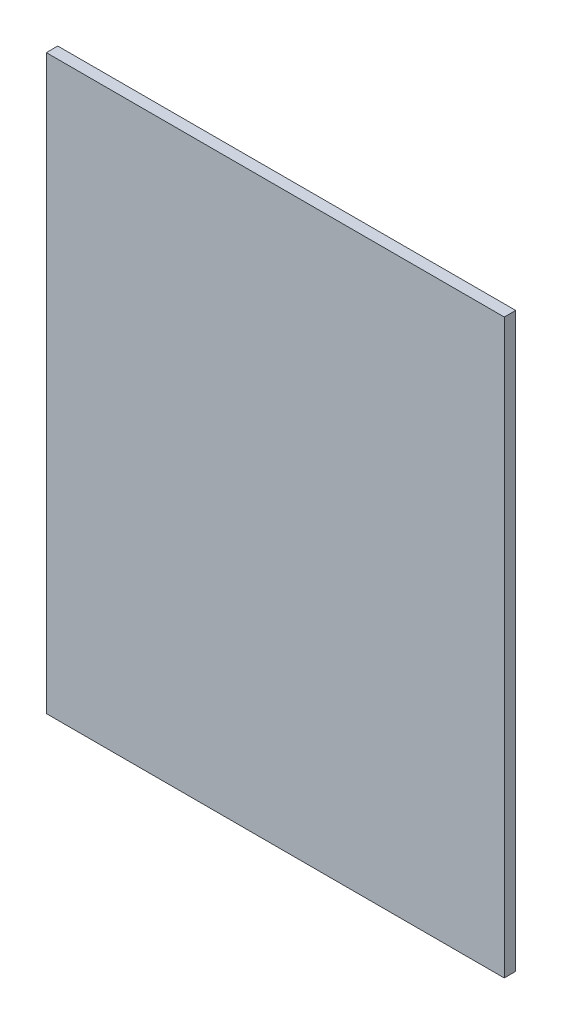
ISO-10303-21;
HEADER;
FILE_DESCRIPTION(('STEP AP214'),'2;1');
FILE_NAME('part.step','',(''),(''),'','','');
FILE_SCHEMA(('AUTOMOTIVE_DESIGN { 1 0 10303 214 1 1 1 1 }'));
ENDSEC;
DATA;
#1=APPLICATION_CONTEXT('core data for automotive mechanical design processes');
#2=APPLICATION_PROTOCOL_DEFINITION('international standard','automotive_design',2000,#1);
#3=PRODUCT_CONTEXT('',#1,'mechanical');
#4=PRODUCT('Part','Part','',(#3));
#5=PRODUCT_RELATED_PRODUCT_CATEGORY('part','',(#4));
#6=PRODUCT_DEFINITION_FORMATION('','',#4);
#7=PRODUCT_DEFINITION_CONTEXT('part definition',#1,'design');
#8=PRODUCT_DEFINITION('design','',#6,#7);
#9=PRODUCT_DEFINITION_SHAPE('','',#8);
#10=(LENGTH_UNIT() NAMED_UNIT(*) SI_UNIT(.MILLI.,.METRE.));
#11=(NAMED_UNIT(*) PLANE_ANGLE_UNIT() SI_UNIT($,.RADIAN.));
#12=(NAMED_UNIT(*) SI_UNIT($,.STERADIAN.) SOLID_ANGLE_UNIT());
#13=UNCERTAINTY_MEASURE_WITH_UNIT(LENGTH_MEASURE(1.E-05),#10,'distance_accuracy_value','');
#14=(GEOMETRIC_REPRESENTATION_CONTEXT(3) GLOBAL_UNCERTAINTY_ASSIGNED_CONTEXT((#13)) GLOBAL_UNIT_ASSIGNED_CONTEXT((#10,
#11,#12)) REPRESENTATION_CONTEXT('',''));
#15=CARTESIAN_POINT('',(0.,0.,0.));
#16=DIRECTION('',(0.,0.,1.));
#17=DIRECTION('',(1.,0.,0.));
#18=AXIS2_PLACEMENT_3D('',#15,#16,#17);
#19=CARTESIAN_POINT('',(0.,0.,0.));
#20=DIRECTION('',(0.,0.,-1.));
#21=DIRECTION('',(-1.,0.,0.));
#22=AXIS2_PLACEMENT_3D('',#19,#20,#21);
#23=PLANE('',#22);
#24=DIRECTION('',(0.,-1.,0.));
#25=VECTOR('',#24,1.);
#26=CARTESIAN_POINT('',(0.,0.,0.));
#27=LINE('',#26,#25);
#28=CARTESIAN_POINT('',(0.,1000.,0.));
#29=VERTEX_POINT('',#28);
#30=CARTESIAN_POINT('',(0.,0.,0.));
#31=VERTEX_POINT('',#30);
#32=EDGE_CURVE('E131',#29,#31,#27,.T.);
#33=ORIENTED_EDGE('',*,*,#32,.F.);
#34=DIRECTION('',(-1.,0.,0.));
#35=VECTOR('',#34,1.);
#36=CARTESIAN_POINT('',(0.,1000.,0.));
#37=LINE('',#36,#35);
#38=CARTESIAN_POINT('',(800.,1000.,0.));
#39=VERTEX_POINT('',#38);
#40=EDGE_CURVE('E79',#39,#29,#37,.T.);
#41=ORIENTED_EDGE('',*,*,#40,.F.);
#42=DIRECTION('',(0.,1.,0.));
#43=VECTOR('',#42,1.);
#44=CARTESIAN_POINT('',(800.,0.,0.));
#45=LINE('',#44,#43);
#46=CARTESIAN_POINT('',(800.,0.,0.));
#47=VERTEX_POINT('',#46);
#48=EDGE_CURVE('E159',#47,#39,#45,.T.);
#49=ORIENTED_EDGE('',*,*,#48,.F.);
#50=DIRECTION('',(1.,0.,0.));
#51=VECTOR('',#50,1.);
#52=CARTESIAN_POINT('',(0.,0.,0.));
#53=LINE('',#52,#51);
#54=EDGE_CURVE('E135',#31,#47,#53,.T.);
#55=ORIENTED_EDGE('',*,*,#54,.F.);
#56=EDGE_LOOP('',(#33,#41,#49,#55));
#57=FACE_BOUND('',#56,.T.);
#58=DIRECTION('',(-1.,0.,0.));
#59=VECTOR('',#58,1.);
#60=CARTESIAN_POINT('',(0.,998.2,0.));
#61=LINE('',#60,#59);
#62=CARTESIAN_POINT('',(798.2,998.2,0.));
#63=VERTEX_POINT('',#62);
#64=CARTESIAN_POINT('',(1.8,998.2,0.));
#65=VERTEX_POINT('',#64);
#66=EDGE_CURVE('E126',#63,#65,#61,.T.);
#67=ORIENTED_EDGE('',*,*,#66,.T.);
#68=DIRECTION('',(0.,-1.,0.));
#69=VECTOR('',#68,1.);
#70=CARTESIAN_POINT('',(1.8,0.,0.));
#71=LINE('',#70,#69);
#72=CARTESIAN_POINT('',(1.8,1.8,0.));
#73=VERTEX_POINT('',#72);
#74=EDGE_CURVE('E145',#65,#73,#71,.T.);
#75=ORIENTED_EDGE('',*,*,#74,.T.);
#76=DIRECTION('',(1.,0.,0.));
#77=VECTOR('',#76,1.);
#78=CARTESIAN_POINT('',(0.,1.8,0.));
#79=LINE('',#78,#77);
#80=CARTESIAN_POINT('',(798.2,1.8,0.));
#81=VERTEX_POINT('',#80);
#82=EDGE_CURVE('E130',#73,#81,#79,.T.);
#83=ORIENTED_EDGE('',*,*,#82,.T.);
#84=DIRECTION('',(0.,1.,0.));
#85=VECTOR('',#84,1.);
#86=CARTESIAN_POINT('',(798.2,0.,0.));
#87=LINE('',#86,#85);
#88=EDGE_CURVE('E49',#81,#63,#87,.T.);
#89=ORIENTED_EDGE('',*,*,#88,.T.);
#90=EDGE_LOOP('',(#67,#75,#83,#89));
#91=FACE_BOUND('',#90,.T.);
#92=ADVANCED_FACE('F34',(#57,#91),#23,.T.);
#93=CARTESIAN_POINT('',(0.,0.,20.));
#94=DIRECTION('',(1.,0.,0.));
#95=DIRECTION('',(0.,0.,-1.));
#96=AXIS2_PLACEMENT_3D('',#93,#94,#95);
#97=PLANE('',#96);
#98=ORIENTED_EDGE('',*,*,#32,.T.);
#99=DIRECTION('',(0.,0.,-1.));
#100=VECTOR('',#99,1.);
#101=CARTESIAN_POINT('',(0.,0.,20.));
#102=LINE('',#101,#100);
#103=CARTESIAN_POINT('',(0.,0.,20.));
#104=VERTEX_POINT('',#103);
#105=EDGE_CURVE('E11',#104,#31,#102,.T.);
#106=ORIENTED_EDGE('',*,*,#105,.F.);
#107=DIRECTION('',(0.,-1.,0.));
#108=VECTOR('',#107,1.);
#109=CARTESIAN_POINT('',(0.,0.,20.));
#110=LINE('',#109,#108);
#111=CARTESIAN_POINT('',(0.,1000.,20.));
#112=VERTEX_POINT('',#111);
#113=EDGE_CURVE('E151',#112,#104,#110,.T.);
#114=ORIENTED_EDGE('',*,*,#113,.F.);
#115=DIRECTION('',(0.,0.,-1.));
#116=VECTOR('',#115,1.);
#117=CARTESIAN_POINT('',(0.,1000.,20.));
#118=LINE('',#117,#116);
#119=EDGE_CURVE('E156',#112,#29,#118,.T.);
#120=ORIENTED_EDGE('',*,*,#119,.T.);
#121=EDGE_LOOP('',(#98,#106,#114,#120));
#122=FACE_BOUND('',#121,.T.);
#123=ADVANCED_FACE('F36',(#122),#97,.F.);
#124=CARTESIAN_POINT('',(0.,0.,20.));
#125=DIRECTION('',(0.,1.,0.));
#126=DIRECTION('',(0.,0.,1.));
#127=AXIS2_PLACEMENT_3D('',#124,#125,#126);
#128=PLANE('',#127);
#129=ORIENTED_EDGE('',*,*,#54,.T.);
#130=DIRECTION('',(0.,0.,-1.));
#131=VECTOR('',#130,1.);
#132=CARTESIAN_POINT('',(800.,0.,20.));
#133=LINE('',#132,#131);
#134=CARTESIAN_POINT('',(800.,0.,20.));
#135=VERTEX_POINT('',#134);
#136=EDGE_CURVE('E42',#135,#47,#133,.T.);
#137=ORIENTED_EDGE('',*,*,#136,.F.);
#138=DIRECTION('',(1.,0.,0.));
#139=VECTOR('',#138,1.);
#140=CARTESIAN_POINT('',(0.,0.,20.));
#141=LINE('',#140,#139);
#142=EDGE_CURVE('E86',#104,#135,#141,.T.);
#143=ORIENTED_EDGE('',*,*,#142,.F.);
#144=ORIENTED_EDGE('',*,*,#105,.T.);
#145=EDGE_LOOP('',(#129,#137,#143,#144));
#146=FACE_BOUND('',#145,.T.);
#147=ADVANCED_FACE('F185',(#146),#128,.F.);
#148=CARTESIAN_POINT('',(800.,0.,20.));
#149=DIRECTION('',(-1.,0.,0.));
#150=DIRECTION('',(0.,0.,1.));
#151=AXIS2_PLACEMENT_3D('',#148,#149,#150);
#152=PLANE('',#151);
#153=ORIENTED_EDGE('',*,*,#48,.T.);
#154=DIRECTION('',(0.,0.,-1.));
#155=VECTOR('',#154,1.);
#156=CARTESIAN_POINT('',(800.,1000.,20.));
#157=LINE('',#156,#155);
#158=CARTESIAN_POINT('',(800.,1000.,20.));
#159=VERTEX_POINT('',#158);
#160=EDGE_CURVE('E163',#159,#39,#157,.T.);
#161=ORIENTED_EDGE('',*,*,#160,.F.);
#162=DIRECTION('',(0.,1.,0.));
#163=VECTOR('',#162,1.);
#164=CARTESIAN_POINT('',(800.,0.,20.));
#165=LINE('',#164,#163);
#166=EDGE_CURVE('E154',#135,#159,#165,.T.);
#167=ORIENTED_EDGE('',*,*,#166,.F.);
#168=ORIENTED_EDGE('',*,*,#136,.T.);
#169=EDGE_LOOP('',(#153,#161,#167,#168));
#170=FACE_BOUND('',#169,.T.);
#171=ADVANCED_FACE('F168',(#170),#152,.F.);
#172=CARTESIAN_POINT('',(0.,1000.,20.));
#173=DIRECTION('',(0.,-1.,0.));
#174=DIRECTION('',(0.,0.,-1.));
#175=AXIS2_PLACEMENT_3D('',#172,#173,#174);
#176=PLANE('',#175);
#177=ORIENTED_EDGE('',*,*,#40,.T.);
#178=ORIENTED_EDGE('',*,*,#119,.F.);
#179=DIRECTION('',(-1.,0.,0.));
#180=VECTOR('',#179,1.);
#181=CARTESIAN_POINT('',(0.,1000.,20.));
#182=LINE('',#181,#180);
#183=EDGE_CURVE('E58',#159,#112,#182,.T.);
#184=ORIENTED_EDGE('',*,*,#183,.F.);
#185=ORIENTED_EDGE('',*,*,#160,.T.);
#186=EDGE_LOOP('',(#177,#178,#184,#185));
#187=FACE_BOUND('',#186,.T.);
#188=ADVANCED_FACE('F176',(#187),#176,.F.);
#189=CARTESIAN_POINT('',(0.,0.,20.));
#190=DIRECTION('',(0.,0.,-1.));
#191=DIRECTION('',(-1.,0.,0.));
#192=AXIS2_PLACEMENT_3D('',#189,#190,#191);
#193=PLANE('',#192);
#194=ORIENTED_EDGE('',*,*,#113,.T.);
#195=ORIENTED_EDGE('',*,*,#142,.T.);
#196=ORIENTED_EDGE('',*,*,#166,.T.);
#197=ORIENTED_EDGE('',*,*,#183,.T.);
#198=EDGE_LOOP('',(#194,#195,#196,#197));
#199=FACE_BOUND('',#198,.T.);
#200=ADVANCED_FACE('F178',(#199),#193,.F.);
#201=CARTESIAN_POINT('',(1.8,0.,20.));
#202=DIRECTION('',(1.,0.,0.));
#203=DIRECTION('',(0.,0.,-1.));
#204=AXIS2_PLACEMENT_3D('',#201,#202,#203);
#205=PLANE('',#204);
#206=ORIENTED_EDGE('',*,*,#74,.F.);
#207=DIRECTION('',(0.,0.,-1.));
#208=VECTOR('',#207,1.);
#209=CARTESIAN_POINT('',(1.8,998.2,20.));
#210=LINE('',#209,#208);
#211=CARTESIAN_POINT('',(1.8,998.2,18.2));
#212=VERTEX_POINT('',#211);
#213=EDGE_CURVE('E125',#212,#65,#210,.T.);
#214=ORIENTED_EDGE('',*,*,#213,.F.);
#215=DIRECTION('',(0.,-1.,0.));
#216=VECTOR('',#215,1.);
#217=CARTESIAN_POINT('',(1.8,0.,18.2));
#218=LINE('',#217,#216);
#219=CARTESIAN_POINT('',(1.8,1.8,18.2));
#220=VERTEX_POINT('',#219);
#221=EDGE_CURVE('E113',#212,#220,#218,.T.);
#222=ORIENTED_EDGE('',*,*,#221,.T.);
#223=DIRECTION('',(0.,0.,-1.));
#224=VECTOR('',#223,1.);
#225=CARTESIAN_POINT('',(1.8,1.8,20.));
#226=LINE('',#225,#224);
#227=EDGE_CURVE('E123',#220,#73,#226,.T.);
#228=ORIENTED_EDGE('',*,*,#227,.T.);
#229=EDGE_LOOP('',(#206,#214,#222,#228));
#230=FACE_BOUND('',#229,.T.);
#231=ADVANCED_FACE('F122',(#230),#205,.T.);
#232=CARTESIAN_POINT('',(0.,1.8,20.));
#233=DIRECTION('',(0.,1.,0.));
#234=DIRECTION('',(0.,0.,1.));
#235=AXIS2_PLACEMENT_3D('',#232,#233,#234);
#236=PLANE('',#235);
#237=ORIENTED_EDGE('',*,*,#82,.F.);
#238=ORIENTED_EDGE('',*,*,#227,.F.);
#239=DIRECTION('',(1.,0.,0.));
#240=VECTOR('',#239,1.);
#241=CARTESIAN_POINT('',(0.,1.8,18.2));
#242=LINE('',#241,#240);
#243=CARTESIAN_POINT('',(798.2,1.8,18.2));
#244=VERTEX_POINT('',#243);
#245=EDGE_CURVE('E109',#220,#244,#242,.T.);
#246=ORIENTED_EDGE('',*,*,#245,.T.);
#247=DIRECTION('',(0.,0.,-1.));
#248=VECTOR('',#247,1.);
#249=CARTESIAN_POINT('',(798.2,1.8,20.));
#250=LINE('',#249,#248);
#251=EDGE_CURVE('E132',#244,#81,#250,.T.);
#252=ORIENTED_EDGE('',*,*,#251,.T.);
#253=EDGE_LOOP('',(#237,#238,#246,#252));
#254=FACE_BOUND('',#253,.T.);
#255=ADVANCED_FACE('F128',(#254),#236,.T.);
#256=CARTESIAN_POINT('',(798.2,0.,20.));
#257=DIRECTION('',(-1.,0.,0.));
#258=DIRECTION('',(0.,0.,1.));
#259=AXIS2_PLACEMENT_3D('',#256,#257,#258);
#260=PLANE('',#259);
#261=ORIENTED_EDGE('',*,*,#88,.F.);
#262=ORIENTED_EDGE('',*,*,#251,.F.);
#263=DIRECTION('',(0.,1.,0.));
#264=VECTOR('',#263,1.);
#265=CARTESIAN_POINT('',(798.2,0.,18.2));
#266=LINE('',#265,#264);
#267=CARTESIAN_POINT('',(798.2,998.2,18.2));
#268=VERTEX_POINT('',#267);
#269=EDGE_CURVE('E114',#244,#268,#266,.T.);
#270=ORIENTED_EDGE('',*,*,#269,.T.);
#271=DIRECTION('',(0.,0.,-1.));
#272=VECTOR('',#271,1.);
#273=CARTESIAN_POINT('',(798.2,998.2,20.));
#274=LINE('',#273,#272);
#275=EDGE_CURVE('E137',#268,#63,#274,.T.);
#276=ORIENTED_EDGE('',*,*,#275,.T.);
#277=EDGE_LOOP('',(#261,#262,#270,#276));
#278=FACE_BOUND('',#277,.T.);
#279=ADVANCED_FACE('F198',(#278),#260,.T.);
#280=CARTESIAN_POINT('',(0.,998.2,20.));
#281=DIRECTION('',(0.,-1.,0.));
#282=DIRECTION('',(0.,0.,-1.));
#283=AXIS2_PLACEMENT_3D('',#280,#281,#282);
#284=PLANE('',#283);
#285=ORIENTED_EDGE('',*,*,#66,.F.);
#286=ORIENTED_EDGE('',*,*,#275,.F.);
#287=DIRECTION('',(-1.,0.,0.));
#288=VECTOR('',#287,1.);
#289=CARTESIAN_POINT('',(0.,998.2,18.2));
#290=LINE('',#289,#288);
#291=EDGE_CURVE('E140',#268,#212,#290,.T.);
#292=ORIENTED_EDGE('',*,*,#291,.T.);
#293=ORIENTED_EDGE('',*,*,#213,.T.);
#294=EDGE_LOOP('',(#285,#286,#292,#293));
#295=FACE_BOUND('',#294,.T.);
#296=ADVANCED_FACE('F195',(#295),#284,.T.);
#297=CARTESIAN_POINT('',(0.,0.,18.2));
#298=DIRECTION('',(0.,0.,-1.));
#299=DIRECTION('',(-1.,0.,0.));
#300=AXIS2_PLACEMENT_3D('',#297,#298,#299);
#301=PLANE('',#300);
#302=ORIENTED_EDGE('',*,*,#221,.F.);
#303=ORIENTED_EDGE('',*,*,#291,.F.);
#304=ORIENTED_EDGE('',*,*,#269,.F.);
#305=ORIENTED_EDGE('',*,*,#245,.F.);
#306=EDGE_LOOP('',(#302,#303,#304,#305));
#307=FACE_BOUND('',#306,.T.);
#308=ADVANCED_FACE('F111',(#307),#301,.T.);
#309=CLOSED_SHELL('',(#92,#123,#147,#171,#188,#200,#231,#255,#279,#296,#308));
#310=MANIFOLD_SOLID_BREP('B2',#309);
#311=ADVANCED_BREP_SHAPE_REPRESENTATION('',(#18,#310),#14);
#312=SHAPE_DEFINITION_REPRESENTATION(#9,#311);
ENDSEC;
END-ISO-10303-21;
